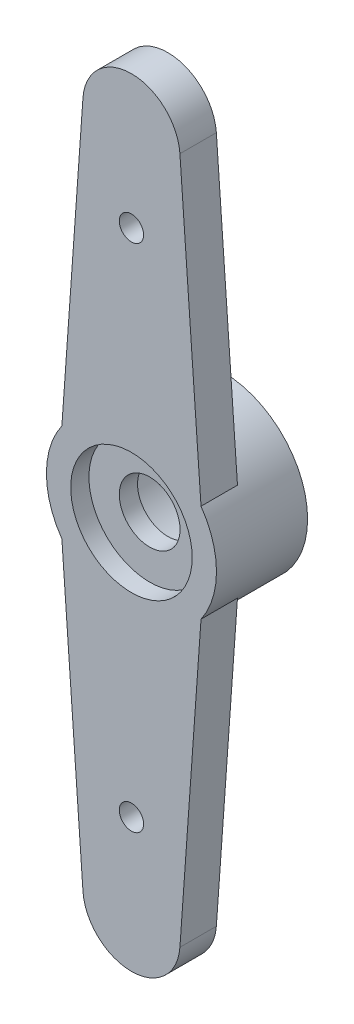
ISO-10303-21;
HEADER;
FILE_DESCRIPTION(('STEP AP214'),'2;1');
FILE_NAME('part.step','',(''),(''),'','','');
FILE_SCHEMA(('AUTOMOTIVE_DESIGN { 1 0 10303 214 1 1 1 1 }'));
ENDSEC;
DATA;
#1=APPLICATION_CONTEXT('core data for automotive mechanical design processes');
#2=APPLICATION_PROTOCOL_DEFINITION('international standard','automotive_design',2000,#1);
#3=PRODUCT_CONTEXT('',#1,'mechanical');
#4=PRODUCT('Part','Part','',(#3));
#5=PRODUCT_RELATED_PRODUCT_CATEGORY('part','',(#4));
#6=PRODUCT_DEFINITION_FORMATION('','',#4);
#7=PRODUCT_DEFINITION_CONTEXT('part definition',#1,'design');
#8=PRODUCT_DEFINITION('design','',#6,#7);
#9=PRODUCT_DEFINITION_SHAPE('','',#8);
#10=(LENGTH_UNIT() NAMED_UNIT(*) SI_UNIT(.MILLI.,.METRE.));
#11=(NAMED_UNIT(*) PLANE_ANGLE_UNIT() SI_UNIT($,.RADIAN.));
#12=(NAMED_UNIT(*) SI_UNIT($,.STERADIAN.) SOLID_ANGLE_UNIT());
#13=UNCERTAINTY_MEASURE_WITH_UNIT(LENGTH_MEASURE(1.E-05),#10,'distance_accuracy_value','');
#14=(GEOMETRIC_REPRESENTATION_CONTEXT(3) GLOBAL_UNCERTAINTY_ASSIGNED_CONTEXT((#13)) GLOBAL_UNIT_ASSIGNED_CONTEXT((#10,
#11,#12)) REPRESENTATION_CONTEXT('',''));
#15=CARTESIAN_POINT('',(0.,0.,0.));
#16=DIRECTION('',(0.,0.,1.));
#17=DIRECTION('',(1.,0.,0.));
#18=AXIS2_PLACEMENT_3D('',#15,#16,#17);
#19=CARTESIAN_POINT('',(0.,0.,1.5));
#20=DIRECTION('',(0.,0.,-1.));
#21=DIRECTION('',(-1.,0.,0.));
#22=AXIS2_PLACEMENT_3D('',#19,#20,#21);
#23=CYLINDRICAL_SURFACE('',#22,1.2499975);
#24=CARTESIAN_POINT('',(0.,0.,0.));
#25=DIRECTION('',(0.,0.,1.));
#26=DIRECTION('',(1.,0.,0.));
#27=AXIS2_PLACEMENT_3D('',#24,#25,#26);
#28=CIRCLE('',#27,1.2499975);
#29=CARTESIAN_POINT('',(1.2499975,0.,0.));
#30=VERTEX_POINT('',#29);
#31=EDGE_CURVE('E124',#30,#30,#28,.T.);
#32=ORIENTED_EDGE('',*,*,#31,.F.);
#33=EDGE_LOOP('',(#32));
#34=FACE_BOUND('',#33,.T.);
#35=CARTESIAN_POINT('',(0.,0.,0.75));
#36=DIRECTION('',(0.,0.,1.));
#37=DIRECTION('',(1.,0.,0.));
#38=AXIS2_PLACEMENT_3D('',#35,#36,#37);
#39=CIRCLE('',#38,1.2499975);
#40=CARTESIAN_POINT('',(1.2499975,0.,0.75));
#41=VERTEX_POINT('',#40);
#42=EDGE_CURVE('E201',#41,#41,#39,.T.);
#43=ORIENTED_EDGE('',*,*,#42,.T.);
#44=EDGE_LOOP('',(#43));
#45=FACE_BOUND('',#44,.T.);
#46=ADVANCED_FACE('F32',(#34,#45),#23,.F.);
#47=CARTESIAN_POINT('',(0.,0.,0.));
#48=DIRECTION('',(0.,0.,1.));
#49=DIRECTION('',(1.,0.,0.));
#50=AXIS2_PLACEMENT_3D('',#47,#48,#49);
#51=PLANE('',#50);
#52=CARTESIAN_POINT('',(0.,0.,0.));
#53=DIRECTION('',(0.,0.,-1.));
#54=DIRECTION('',(-1.,0.,0.));
#55=AXIS2_PLACEMENT_3D('',#52,#53,#54);
#56=CIRCLE('',#55,3.5);
#57=CARTESIAN_POINT('',(-2.86356746382677,2.0124565535963,0.));
#58=VERTEX_POINT('',#57);
#59=CARTESIAN_POINT('',(2.86356746382677,2.0124565535963,0.));
#60=VERTEX_POINT('',#59);
#61=EDGE_CURVE('E43',#58,#60,#56,.T.);
#62=ORIENTED_EDGE('',*,*,#61,.F.);
#63=DIRECTION('',(-0.0714285714285715,-0.997445717412067,0.));
#64=VECTOR('',#63,1.);
#65=CARTESIAN_POINT('',(-1.99489143482413,14.1428571428571,0.));
#66=LINE('',#65,#64);
#67=CARTESIAN_POINT('',(-1.99489143482413,14.1428571428571,0.));
#68=VERTEX_POINT('',#67);
#69=EDGE_CURVE('E131',#68,#58,#66,.T.);
#70=ORIENTED_EDGE('',*,*,#69,.F.);
#71=CARTESIAN_POINT('',(0.,14.,0.));
#72=DIRECTION('',(0.,0.,1.));
#73=DIRECTION('',(1.,0.,0.));
#74=AXIS2_PLACEMENT_3D('',#71,#72,#73);
#75=CIRCLE('',#74,2.);
#76=CARTESIAN_POINT('',(1.99489143482413,14.1428571428571,0.));
#77=VERTEX_POINT('',#76);
#78=EDGE_CURVE('E78',#77,#68,#75,.T.);
#79=ORIENTED_EDGE('',*,*,#78,.F.);
#80=DIRECTION('',(-0.0714285714285716,0.997445717412067,0.));
#81=VECTOR('',#80,1.);
#82=CARTESIAN_POINT('',(1.99489143482413,14.1428571428571,0.));
#83=LINE('',#82,#81);
#84=EDGE_CURVE('E71',#60,#77,#83,.T.);
#85=ORIENTED_EDGE('',*,*,#84,.F.);
#86=EDGE_LOOP('',(#62,#70,#79,#85));
#87=FACE_BOUND('',#86,.T.);
#88=CARTESIAN_POINT('',(0.,10.5,0.));
#89=DIRECTION('',(0.,0.,1.));
#90=DIRECTION('',(1.,0.,0.));
#91=AXIS2_PLACEMENT_3D('',#88,#89,#90);
#92=CIRCLE('',#91,0.5);
#93=CARTESIAN_POINT('',(0.5,10.5,0.));
#94=VERTEX_POINT('',#93);
#95=EDGE_CURVE('E175',#94,#94,#92,.F.);
#96=ORIENTED_EDGE('',*,*,#95,.F.);
#97=EDGE_LOOP('',(#96));
#98=FACE_BOUND('',#97,.T.);
#99=ADVANCED_FACE('F246',(#87,#98),#51,.F.);
#100=ORIENTED_EDGE('',*,*,#31,.T.);
#101=EDGE_LOOP('',(#100));
#102=FACE_BOUND('',#101,.T.);
#103=CARTESIAN_POINT('',(0.,0.,0.));
#104=DIRECTION('',(0.,0.,-1.));
#105=DIRECTION('',(-1.,0.,0.));
#106=AXIS2_PLACEMENT_3D('',#103,#104,#105);
#107=CIRCLE('',#106,2.5);
#108=CARTESIAN_POINT('',(-2.5,0.,0.));
#109=VERTEX_POINT('',#108);
#110=EDGE_CURVE('E192',#109,#109,#107,.T.);
#111=ORIENTED_EDGE('',*,*,#110,.T.);
#112=EDGE_LOOP('',(#111));
#113=FACE_BOUND('',#112,.T.);
#114=ADVANCED_FACE('F223',(#102,#113),#51,.F.);
#115=CARTESIAN_POINT('',(0.,0.,1.5));
#116=DIRECTION('',(0.,0.,1.));
#117=DIRECTION('',(1.,0.,0.));
#118=AXIS2_PLACEMENT_3D('',#115,#116,#117);
#119=PLANE('',#118);
#120=CARTESIAN_POINT('',(0.,0.,1.5));
#121=DIRECTION('',(0.,0.,1.));
#122=DIRECTION('',(1.,0.,0.));
#123=AXIS2_PLACEMENT_3D('',#120,#121,#122);
#124=CIRCLE('',#123,2.5);
#125=CARTESIAN_POINT('',(2.5,0.,1.5));
#126=VERTEX_POINT('',#125);
#127=EDGE_CURVE('E198',#126,#126,#124,.T.);
#128=ORIENTED_EDGE('',*,*,#127,.F.);
#129=EDGE_LOOP('',(#128));
#130=FACE_BOUND('',#129,.T.);
#131=CARTESIAN_POINT('',(0.,10.5,1.5));
#132=DIRECTION('',(0.,0.,1.));
#133=DIRECTION('',(1.,0.,0.));
#134=AXIS2_PLACEMENT_3D('',#131,#132,#133);
#135=CIRCLE('',#134,0.5);
#136=CARTESIAN_POINT('',(0.5,10.5,1.5));
#137=VERTEX_POINT('',#136);
#138=EDGE_CURVE('E179',#137,#137,#135,.T.);
#139=ORIENTED_EDGE('',*,*,#138,.F.);
#140=EDGE_LOOP('',(#139));
#141=FACE_BOUND('',#140,.T.);
#142=CARTESIAN_POINT('',(0.,-10.5,1.5));
#143=DIRECTION('',(0.,0.,1.));
#144=DIRECTION('',(1.,0.,0.));
#145=AXIS2_PLACEMENT_3D('',#142,#143,#144);
#146=CIRCLE('',#145,0.5);
#147=CARTESIAN_POINT('',(0.5,-10.5,1.5));
#148=VERTEX_POINT('',#147);
#149=EDGE_CURVE('E180',#148,#148,#146,.T.);
#150=ORIENTED_EDGE('',*,*,#149,.F.);
#151=EDGE_LOOP('',(#150));
#152=FACE_BOUND('',#151,.T.);
#153=CARTESIAN_POINT('',(0.,0.,1.5));
#154=DIRECTION('',(0.,0.,1.));
#155=DIRECTION('',(1.,0.,0.));
#156=AXIS2_PLACEMENT_3D('',#153,#154,#155);
#157=CIRCLE('',#156,3.5);
#158=CARTESIAN_POINT('',(-2.86356746382677,2.0124565535963,1.5));
#159=VERTEX_POINT('',#158);
#160=CARTESIAN_POINT('',(-2.86356746382677,-2.0124565535963,1.5));
#161=VERTEX_POINT('',#160);
#162=EDGE_CURVE('E134',#159,#161,#157,.T.);
#163=ORIENTED_EDGE('',*,*,#162,.T.);
#164=DIRECTION('',(0.0714285714285715,-0.997445717412067,0.));
#165=VECTOR('',#164,1.);
#166=CARTESIAN_POINT('',(-1.99489143482413,-14.1428571428571,1.5));
#167=LINE('',#166,#165);
#168=CARTESIAN_POINT('',(-1.99489143482413,-14.1428571428571,1.5));
#169=VERTEX_POINT('',#168);
#170=EDGE_CURVE('E87',#161,#169,#167,.T.);
#171=ORIENTED_EDGE('',*,*,#170,.T.);
#172=CARTESIAN_POINT('',(0.,-14.,1.5));
#173=DIRECTION('',(0.,0.,1.));
#174=DIRECTION('',(1.,0.,0.));
#175=AXIS2_PLACEMENT_3D('',#172,#173,#174);
#176=CIRCLE('',#175,2.);
#177=CARTESIAN_POINT('',(1.99489143482413,-14.1428571428571,1.5));
#178=VERTEX_POINT('',#177);
#179=EDGE_CURVE('E167',#169,#178,#176,.T.);
#180=ORIENTED_EDGE('',*,*,#179,.T.);
#181=DIRECTION('',(0.0714285714285715,0.997445717412067,0.));
#182=VECTOR('',#181,1.);
#183=CARTESIAN_POINT('',(1.99489143482413,-14.1428571428571,1.5));
#184=LINE('',#183,#182);
#185=CARTESIAN_POINT('',(2.86356746382677,-2.0124565535963,1.5));
#186=VERTEX_POINT('',#185);
#187=EDGE_CURVE('E166',#178,#186,#184,.T.);
#188=ORIENTED_EDGE('',*,*,#187,.T.);
#189=CARTESIAN_POINT('',(0.,0.,1.5));
#190=DIRECTION('',(0.,0.,1.));
#191=DIRECTION('',(1.,0.,0.));
#192=AXIS2_PLACEMENT_3D('',#189,#190,#191);
#193=CIRCLE('',#192,3.5);
#194=CARTESIAN_POINT('',(2.86356746382678,2.0124565535963,1.5));
#195=VERTEX_POINT('',#194);
#196=EDGE_CURVE('E107',#186,#195,#193,.T.);
#197=ORIENTED_EDGE('',*,*,#196,.T.);
#198=DIRECTION('',(-0.0714285714285716,0.997445717412067,0.));
#199=VECTOR('',#198,1.);
#200=CARTESIAN_POINT('',(1.99489143482413,14.1428571428571,1.5));
#201=LINE('',#200,#199);
#202=CARTESIAN_POINT('',(1.99489143482413,14.1428571428571,1.5));
#203=VERTEX_POINT('',#202);
#204=EDGE_CURVE('E102',#195,#203,#201,.T.);
#205=ORIENTED_EDGE('',*,*,#204,.T.);
#206=CARTESIAN_POINT('',(0.,14.,1.5));
#207=DIRECTION('',(0.,0.,1.));
#208=DIRECTION('',(1.,0.,0.));
#209=AXIS2_PLACEMENT_3D('',#206,#207,#208);
#210=CIRCLE('',#209,2.);
#211=CARTESIAN_POINT('',(-1.99489143482413,14.1428571428571,1.5));
#212=VERTEX_POINT('',#211);
#213=EDGE_CURVE('E105',#203,#212,#210,.T.);
#214=ORIENTED_EDGE('',*,*,#213,.T.);
#215=DIRECTION('',(-0.0714285714285715,-0.997445717412067,0.));
#216=VECTOR('',#215,1.);
#217=CARTESIAN_POINT('',(-1.99489143482413,14.1428571428571,1.5));
#218=LINE('',#217,#216);
#219=EDGE_CURVE('E51',#212,#159,#218,.T.);
#220=ORIENTED_EDGE('',*,*,#219,.T.);
#221=EDGE_LOOP('',(#163,#171,#180,#188,#197,#205,#214,#220));
#222=FACE_BOUND('',#221,.T.);
#223=ADVANCED_FACE('F103',(#130,#141,#152,#222),#119,.T.);
#224=CARTESIAN_POINT('',(2.86356746382677,-2.0124565535963,0.));
#225=VERTEX_POINT('',#224);
#226=CARTESIAN_POINT('',(-2.86356746382677,-2.0124565535963,0.));
#227=VERTEX_POINT('',#226);
#228=EDGE_CURVE('E11',#225,#227,#56,.T.);
#229=ORIENTED_EDGE('',*,*,#228,.F.);
#230=DIRECTION('',(0.0714285714285715,0.997445717412067,0.));
#231=VECTOR('',#230,1.);
#232=CARTESIAN_POINT('',(1.99489143482413,-14.1428571428571,0.));
#233=LINE('',#232,#231);
#234=CARTESIAN_POINT('',(1.99489143482413,-14.1428571428571,0.));
#235=VERTEX_POINT('',#234);
#236=EDGE_CURVE('E126',#235,#225,#233,.T.);
#237=ORIENTED_EDGE('',*,*,#236,.F.);
#238=CARTESIAN_POINT('',(0.,-14.,0.));
#239=DIRECTION('',(0.,0.,1.));
#240=DIRECTION('',(1.,0.,0.));
#241=AXIS2_PLACEMENT_3D('',#238,#239,#240);
#242=CIRCLE('',#241,2.);
#243=CARTESIAN_POINT('',(-1.99489143482413,-14.1428571428571,0.));
#244=VERTEX_POINT('',#243);
#245=EDGE_CURVE('E123',#244,#235,#242,.T.);
#246=ORIENTED_EDGE('',*,*,#245,.F.);
#247=DIRECTION('',(0.0714285714285715,-0.997445717412067,0.));
#248=VECTOR('',#247,1.);
#249=CARTESIAN_POINT('',(-1.99489143482413,-14.1428571428571,0.));
#250=LINE('',#249,#248);
#251=EDGE_CURVE('E121',#227,#244,#250,.T.);
#252=ORIENTED_EDGE('',*,*,#251,.F.);
#253=EDGE_LOOP('',(#229,#237,#246,#252));
#254=FACE_BOUND('',#253,.T.);
#255=CARTESIAN_POINT('',(0.,-10.5,0.));
#256=DIRECTION('',(0.,0.,1.));
#257=DIRECTION('',(1.,0.,0.));
#258=AXIS2_PLACEMENT_3D('',#255,#256,#257);
#259=CIRCLE('',#258,0.5);
#260=CARTESIAN_POINT('',(0.5,-10.5,0.));
#261=VERTEX_POINT('',#260);
#262=EDGE_CURVE('E176',#261,#261,#259,.F.);
#263=ORIENTED_EDGE('',*,*,#262,.F.);
#264=EDGE_LOOP('',(#263));
#265=FACE_BOUND('',#264,.T.);
#266=ADVANCED_FACE('F159',(#254,#265),#51,.F.);
#267=CARTESIAN_POINT('',(-1.99489143482413,-14.1428571428571,1.5));
#268=DIRECTION('',(0.997445717412067,0.0714285714285715,0.));
#269=DIRECTION('',(-0.0714285714285715,0.997445717412067,0.));
#270=AXIS2_PLACEMENT_3D('',#267,#268,#269);
#271=PLANE('',#270);
#272=ORIENTED_EDGE('',*,*,#251,.T.);
#273=DIRECTION('',(0.,0.,-1.));
#274=VECTOR('',#273,1.);
#275=CARTESIAN_POINT('',(-1.99489143482413,-14.1428571428571,1.5));
#276=LINE('',#275,#274);
#277=EDGE_CURVE('E144',#169,#244,#276,.T.);
#278=ORIENTED_EDGE('',*,*,#277,.F.);
#279=ORIENTED_EDGE('',*,*,#170,.F.);
#280=DIRECTION('',(0.,0.,-1.));
#281=VECTOR('',#280,1.);
#282=CARTESIAN_POINT('',(-2.86356746382677,-2.0124565535963,1.5));
#283=LINE('',#282,#281);
#284=EDGE_CURVE('E36',#161,#227,#283,.T.);
#285=ORIENTED_EDGE('',*,*,#284,.T.);
#286=EDGE_LOOP('',(#272,#278,#279,#285));
#287=FACE_BOUND('',#286,.T.);
#288=ADVANCED_FACE('F34',(#287),#271,.F.);
#289=CARTESIAN_POINT('',(0.,-14.,1.5));
#290=DIRECTION('',(0.,0.,-1.));
#291=DIRECTION('',(-1.,0.,0.));
#292=AXIS2_PLACEMENT_3D('',#289,#290,#291);
#293=CYLINDRICAL_SURFACE('',#292,2.);
#294=ORIENTED_EDGE('',*,*,#245,.T.);
#295=DIRECTION('',(0.,0.,-1.));
#296=VECTOR('',#295,1.);
#297=CARTESIAN_POINT('',(1.99489143482413,-14.1428571428571,1.5));
#298=LINE('',#297,#296);
#299=EDGE_CURVE('E142',#178,#235,#298,.T.);
#300=ORIENTED_EDGE('',*,*,#299,.F.);
#301=ORIENTED_EDGE('',*,*,#179,.F.);
#302=ORIENTED_EDGE('',*,*,#277,.T.);
#303=EDGE_LOOP('',(#294,#300,#301,#302));
#304=FACE_BOUND('',#303,.T.);
#305=ADVANCED_FACE('F162',(#304),#293,.T.);
#306=CARTESIAN_POINT('',(1.99489143482413,-14.1428571428571,1.5));
#307=DIRECTION('',(-0.997445717412067,0.0714285714285715,0.));
#308=DIRECTION('',(-0.0714285714285715,-0.997445717412067,0.));
#309=AXIS2_PLACEMENT_3D('',#306,#307,#308);
#310=PLANE('',#309);
#311=ORIENTED_EDGE('',*,*,#236,.T.);
#312=DIRECTION('',(0.,0.,-1.));
#313=VECTOR('',#312,1.);
#314=CARTESIAN_POINT('',(2.86356746382677,-2.0124565535963,1.5));
#315=LINE('',#314,#313);
#316=EDGE_CURVE('E139',#186,#225,#315,.T.);
#317=ORIENTED_EDGE('',*,*,#316,.F.);
#318=ORIENTED_EDGE('',*,*,#187,.F.);
#319=ORIENTED_EDGE('',*,*,#299,.T.);
#320=EDGE_LOOP('',(#311,#317,#318,#319));
#321=FACE_BOUND('',#320,.T.);
#322=ADVANCED_FACE('F165',(#321),#310,.F.);
#323=CARTESIAN_POINT('',(0.,0.,1.5));
#324=DIRECTION('',(0.,0.,-1.));
#325=DIRECTION('',(-1.,0.,0.));
#326=AXIS2_PLACEMENT_3D('',#323,#324,#325);
#327=CYLINDRICAL_SURFACE('',#326,3.5);
#328=ORIENTED_EDGE('',*,*,#316,.T.);
#329=ORIENTED_EDGE('',*,*,#228,.T.);
#330=ORIENTED_EDGE('',*,*,#284,.F.);
#331=ORIENTED_EDGE('',*,*,#162,.F.);
#332=DIRECTION('',(0.,0.,-1.));
#333=VECTOR('',#332,1.);
#334=CARTESIAN_POINT('',(-2.86356746382677,2.0124565535963,1.5));
#335=LINE('',#334,#333);
#336=EDGE_CURVE('E117',#159,#58,#335,.T.);
#337=ORIENTED_EDGE('',*,*,#336,.T.);
#338=ORIENTED_EDGE('',*,*,#61,.T.);
#339=DIRECTION('',(0.,0.,-1.));
#340=VECTOR('',#339,1.);
#341=CARTESIAN_POINT('',(2.86356746382678,2.0124565535963,1.5));
#342=LINE('',#341,#340);
#343=EDGE_CURVE('E112',#195,#60,#342,.T.);
#344=ORIENTED_EDGE('',*,*,#343,.F.);
#345=ORIENTED_EDGE('',*,*,#196,.F.);
#346=EDGE_LOOP('',(#328,#329,#330,#331,#337,#338,#344,#345));
#347=FACE_BOUND('',#346,.T.);
#348=CARTESIAN_POINT('',(0.,0.,-2.25));
#349=DIRECTION('',(0.,0.,-1.));
#350=DIRECTION('',(-1.,0.,0.));
#351=AXIS2_PLACEMENT_3D('',#348,#349,#350);
#352=CIRCLE('',#351,3.5);
#353=CARTESIAN_POINT('',(-3.5,0.,-2.25));
#354=VERTEX_POINT('',#353);
#355=EDGE_CURVE('E183',#354,#354,#352,.T.);
#356=ORIENTED_EDGE('',*,*,#355,.F.);
#357=EDGE_LOOP('',(#356));
#358=FACE_BOUND('',#357,.T.);
#359=ADVANCED_FACE('F153',(#347,#358),#327,.T.);
#360=CARTESIAN_POINT('',(1.99489143482413,14.1428571428571,1.5));
#361=DIRECTION('',(-0.997445717412067,-0.0714285714285716,0.));
#362=DIRECTION('',(0.0714285714285716,-0.997445717412067,0.));
#363=AXIS2_PLACEMENT_3D('',#360,#361,#362);
#364=PLANE('',#363);
#365=ORIENTED_EDGE('',*,*,#84,.T.);
#366=DIRECTION('',(0.,0.,-1.));
#367=VECTOR('',#366,1.);
#368=CARTESIAN_POINT('',(1.99489143482413,14.1428571428571,1.5));
#369=LINE('',#368,#367);
#370=EDGE_CURVE('E110',#203,#77,#369,.T.);
#371=ORIENTED_EDGE('',*,*,#370,.F.);
#372=ORIENTED_EDGE('',*,*,#204,.F.);
#373=ORIENTED_EDGE('',*,*,#343,.T.);
#374=EDGE_LOOP('',(#365,#371,#372,#373));
#375=FACE_BOUND('',#374,.T.);
#376=ADVANCED_FACE('F111',(#375),#364,.F.);
#377=CARTESIAN_POINT('',(0.,14.,1.5));
#378=DIRECTION('',(0.,0.,-1.));
#379=DIRECTION('',(-1.,0.,0.));
#380=AXIS2_PLACEMENT_3D('',#377,#378,#379);
#381=CYLINDRICAL_SURFACE('',#380,2.);
#382=ORIENTED_EDGE('',*,*,#78,.T.);
#383=DIRECTION('',(0.,0.,-1.));
#384=VECTOR('',#383,1.);
#385=CARTESIAN_POINT('',(-1.99489143482413,14.1428571428571,1.5));
#386=LINE('',#385,#384);
#387=EDGE_CURVE('E113',#212,#68,#386,.T.);
#388=ORIENTED_EDGE('',*,*,#387,.F.);
#389=ORIENTED_EDGE('',*,*,#213,.F.);
#390=ORIENTED_EDGE('',*,*,#370,.T.);
#391=EDGE_LOOP('',(#382,#388,#389,#390));
#392=FACE_BOUND('',#391,.T.);
#393=ADVANCED_FACE('F115',(#392),#381,.T.);
#394=CARTESIAN_POINT('',(-1.99489143482413,14.1428571428571,1.5));
#395=DIRECTION('',(0.997445717412067,-0.0714285714285715,0.));
#396=DIRECTION('',(0.0714285714285715,0.997445717412067,0.));
#397=AXIS2_PLACEMENT_3D('',#394,#395,#396);
#398=PLANE('',#397);
#399=ORIENTED_EDGE('',*,*,#69,.T.);
#400=ORIENTED_EDGE('',*,*,#336,.F.);
#401=ORIENTED_EDGE('',*,*,#219,.F.);
#402=ORIENTED_EDGE('',*,*,#387,.T.);
#403=EDGE_LOOP('',(#399,#400,#401,#402));
#404=FACE_BOUND('',#403,.T.);
#405=ADVANCED_FACE('F232',(#404),#398,.F.);
#406=CARTESIAN_POINT('',(0.,-10.5,-1.4142135623731));
#407=DIRECTION('',(0.,0.,1.));
#408=DIRECTION('',(1.,0.,0.));
#409=AXIS2_PLACEMENT_3D('',#406,#407,#408);
#410=CYLINDRICAL_SURFACE('',#409,0.5);
#411=ORIENTED_EDGE('',*,*,#262,.T.);
#412=EDGE_LOOP('',(#411));
#413=FACE_BOUND('',#412,.T.);
#414=ORIENTED_EDGE('',*,*,#149,.T.);
#415=EDGE_LOOP('',(#414));
#416=FACE_BOUND('',#415,.T.);
#417=ADVANCED_FACE('F229',(#413,#416),#410,.F.);
#418=CARTESIAN_POINT('',(0.,10.5,-1.4142135623731));
#419=DIRECTION('',(0.,0.,1.));
#420=DIRECTION('',(1.,0.,0.));
#421=AXIS2_PLACEMENT_3D('',#418,#419,#420);
#422=CYLINDRICAL_SURFACE('',#421,0.5);
#423=ORIENTED_EDGE('',*,*,#95,.T.);
#424=EDGE_LOOP('',(#423));
#425=FACE_BOUND('',#424,.T.);
#426=ORIENTED_EDGE('',*,*,#138,.T.);
#427=EDGE_LOOP('',(#426));
#428=FACE_BOUND('',#427,.T.);
#429=ADVANCED_FACE('F231',(#425,#428),#422,.F.);
#430=CARTESIAN_POINT('',(0.,0.,-2.25));
#431=DIRECTION('',(0.,0.,-1.));
#432=DIRECTION('',(-1.,0.,0.));
#433=AXIS2_PLACEMENT_3D('',#430,#431,#432);
#434=PLANE('',#433);
#435=ORIENTED_EDGE('',*,*,#355,.T.);
#436=EDGE_LOOP('',(#435));
#437=FACE_BOUND('',#436,.T.);
#438=CARTESIAN_POINT('',(0.,0.,-2.25));
#439=DIRECTION('',(0.,0.,-1.));
#440=DIRECTION('',(-1.,0.,0.));
#441=AXIS2_PLACEMENT_3D('',#438,#439,#440);
#442=CIRCLE('',#441,2.5);
#443=CARTESIAN_POINT('',(-2.5,0.,-2.25));
#444=VERTEX_POINT('',#443);
#445=EDGE_CURVE('E189',#444,#444,#442,.T.);
#446=ORIENTED_EDGE('',*,*,#445,.F.);
#447=EDGE_LOOP('',(#446));
#448=FACE_BOUND('',#447,.T.);
#449=ADVANCED_FACE('F239',(#437,#448),#434,.T.);
#450=CARTESIAN_POINT('',(0.,0.,-2.25));
#451=DIRECTION('',(0.,0.,1.));
#452=DIRECTION('',(1.,0.,0.));
#453=AXIS2_PLACEMENT_3D('',#450,#451,#452);
#454=CYLINDRICAL_SURFACE('',#453,2.5);
#455=ORIENTED_EDGE('',*,*,#445,.T.);
#456=EDGE_LOOP('',(#455));
#457=FACE_BOUND('',#456,.T.);
#458=ORIENTED_EDGE('',*,*,#110,.F.);
#459=EDGE_LOOP('',(#458));
#460=FACE_BOUND('',#459,.T.);
#461=ADVANCED_FACE('F217',(#457,#460),#454,.F.);
#462=CARTESIAN_POINT('',(0.,0.,0.75));
#463=DIRECTION('',(0.,0.,1.));
#464=DIRECTION('',(1.,0.,0.));
#465=AXIS2_PLACEMENT_3D('',#462,#463,#464);
#466=CYLINDRICAL_SURFACE('',#465,2.5);
#467=CARTESIAN_POINT('',(0.,0.,0.75));
#468=DIRECTION('',(0.,0.,1.));
#469=DIRECTION('',(1.,0.,0.));
#470=AXIS2_PLACEMENT_3D('',#467,#468,#469);
#471=CIRCLE('',#470,2.5);
#472=CARTESIAN_POINT('',(2.5,0.,0.75));
#473=VERTEX_POINT('',#472);
#474=EDGE_CURVE('E195',#473,#473,#471,.T.);
#475=ORIENTED_EDGE('',*,*,#474,.F.);
#476=EDGE_LOOP('',(#475));
#477=FACE_BOUND('',#476,.T.);
#478=ORIENTED_EDGE('',*,*,#127,.T.);
#479=EDGE_LOOP('',(#478));
#480=FACE_BOUND('',#479,.T.);
#481=ADVANCED_FACE('F211',(#477,#480),#466,.F.);
#482=CARTESIAN_POINT('',(0.,0.,0.75));
#483=DIRECTION('',(0.,0.,1.));
#484=DIRECTION('',(1.,0.,0.));
#485=AXIS2_PLACEMENT_3D('',#482,#483,#484);
#486=PLANE('',#485);
#487=ORIENTED_EDGE('',*,*,#42,.F.);
#488=EDGE_LOOP('',(#487));
#489=FACE_BOUND('',#488,.T.);
#490=ORIENTED_EDGE('',*,*,#474,.T.);
#491=EDGE_LOOP('',(#490));
#492=FACE_BOUND('',#491,.T.);
#493=ADVANCED_FACE('F208',(#489,#492),#486,.T.);
#494=CLOSED_SHELL('',(#46,#99,#114,#223,#266,#288,#305,#322,#359,#376,#393,#405,#417,#429,#449,
#461,#481,#493));
#495=MANIFOLD_SOLID_BREP('B2',#494);
#496=ADVANCED_BREP_SHAPE_REPRESENTATION('',(#18,#495),#14);
#497=SHAPE_DEFINITION_REPRESENTATION(#9,#496);
ENDSEC;
END-ISO-10303-21;
